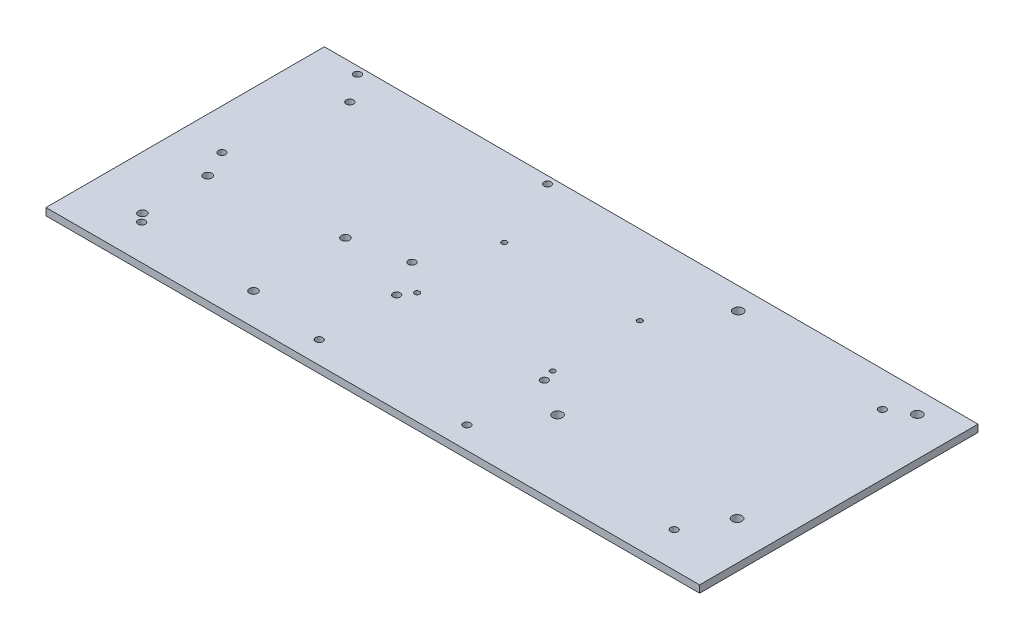
ISO-10303-21;
HEADER;
FILE_DESCRIPTION(('STEP AP214'),'2;1');
FILE_NAME('part.step','',(''),(''),'','','');
FILE_SCHEMA(('AUTOMOTIVE_DESIGN { 1 0 10303 214 1 1 1 1 }'));
ENDSEC;
DATA;
#1=APPLICATION_CONTEXT('core data for automotive mechanical design processes');
#2=APPLICATION_PROTOCOL_DEFINITION('international standard','automotive_design',2000,#1);
#3=PRODUCT_CONTEXT('',#1,'mechanical');
#4=PRODUCT('Part','Part','',(#3));
#5=PRODUCT_RELATED_PRODUCT_CATEGORY('part','',(#4));
#6=PRODUCT_DEFINITION_FORMATION('','',#4);
#7=PRODUCT_DEFINITION_CONTEXT('part definition',#1,'design');
#8=PRODUCT_DEFINITION('design','',#6,#7);
#9=PRODUCT_DEFINITION_SHAPE('','',#8);
#10=(LENGTH_UNIT() NAMED_UNIT(*) SI_UNIT(.MILLI.,.METRE.));
#11=(NAMED_UNIT(*) PLANE_ANGLE_UNIT() SI_UNIT($,.RADIAN.));
#12=(NAMED_UNIT(*) SI_UNIT($,.STERADIAN.) SOLID_ANGLE_UNIT());
#13=UNCERTAINTY_MEASURE_WITH_UNIT(LENGTH_MEASURE(1.E-05),#10,'distance_accuracy_value','');
#14=(GEOMETRIC_REPRESENTATION_CONTEXT(3) GLOBAL_UNCERTAINTY_ASSIGNED_CONTEXT((#13)) GLOBAL_UNIT_ASSIGNED_CONTEXT((#10,
#11,#12)) REPRESENTATION_CONTEXT('',''));
#15=CARTESIAN_POINT('',(0.,0.,0.));
#16=DIRECTION('',(0.,0.,1.));
#17=DIRECTION('',(1.,0.,0.));
#18=AXIS2_PLACEMENT_3D('',#15,#16,#17);
#19=CARTESIAN_POINT('',(-125.,3.,55.));
#20=DIRECTION('',(0.,0.,-1.));
#21=DIRECTION('',(-1.,0.,0.));
#22=AXIS2_PLACEMENT_3D('',#19,#20,#21);
#23=PLANE('',#22);
#24=DIRECTION('',(1.,0.,0.));
#25=VECTOR('',#24,1.);
#26=CARTESIAN_POINT('',(-125.,0.,55.));
#27=LINE('',#26,#25);
#28=CARTESIAN_POINT('',(-135.,0.,55.));
#29=VERTEX_POINT('',#28);
#30=CARTESIAN_POINT('',(135.,0.,55.));
#31=VERTEX_POINT('',#30);
#32=EDGE_CURVE('E75',#29,#31,#27,.T.);
#33=ORIENTED_EDGE('',*,*,#32,.T.);
#34=DIRECTION('',(0.,-1.,0.));
#35=VECTOR('',#34,1.);
#36=CARTESIAN_POINT('',(135.,3.,55.));
#37=LINE('',#36,#35);
#38=CARTESIAN_POINT('',(135.,3.,55.));
#39=VERTEX_POINT('',#38);
#40=EDGE_CURVE('E78',#39,#31,#37,.T.);
#41=ORIENTED_EDGE('',*,*,#40,.F.);
#42=DIRECTION('',(1.,0.,0.));
#43=VECTOR('',#42,1.);
#44=CARTESIAN_POINT('',(-125.,3.,55.));
#45=LINE('',#44,#43);
#46=CARTESIAN_POINT('',(-135.,3.,55.));
#47=VERTEX_POINT('',#46);
#48=EDGE_CURVE('E45',#47,#39,#45,.T.);
#49=ORIENTED_EDGE('',*,*,#48,.F.);
#50=DIRECTION('',(0.,1.,0.));
#51=VECTOR('',#50,1.);
#52=CARTESIAN_POINT('',(-135.,3.,55.));
#53=LINE('',#52,#51);
#54=EDGE_CURVE('E79',#29,#47,#53,.T.);
#55=ORIENTED_EDGE('',*,*,#54,.F.);
#56=EDGE_LOOP('',(#33,#41,#49,#55));
#57=FACE_BOUND('',#56,.T.);
#58=ADVANCED_FACE('F37',(#57),#23,.F.);
#59=CARTESIAN_POINT('',(-125.,3.,-60.));
#60=DIRECTION('',(0.,0.,1.));
#61=DIRECTION('',(1.,0.,0.));
#62=AXIS2_PLACEMENT_3D('',#59,#60,#61);
#63=PLANE('',#62);
#64=DIRECTION('',(-1.,0.,0.));
#65=VECTOR('',#64,1.);
#66=CARTESIAN_POINT('',(-125.,0.,-60.));
#67=LINE('',#66,#65);
#68=CARTESIAN_POINT('',(135.,0.,-60.));
#69=VERTEX_POINT('',#68);
#70=CARTESIAN_POINT('',(-135.,0.,-60.));
#71=VERTEX_POINT('',#70);
#72=EDGE_CURVE('E83',#69,#71,#67,.T.);
#73=ORIENTED_EDGE('',*,*,#72,.T.);
#74=DIRECTION('',(0.,-1.,0.));
#75=VECTOR('',#74,1.);
#76=CARTESIAN_POINT('',(-135.,3.,-60.));
#77=LINE('',#76,#75);
#78=CARTESIAN_POINT('',(-135.,3.,-60.));
#79=VERTEX_POINT('',#78);
#80=EDGE_CURVE('E106',#79,#71,#77,.T.);
#81=ORIENTED_EDGE('',*,*,#80,.F.);
#82=DIRECTION('',(-1.,0.,0.));
#83=VECTOR('',#82,1.);
#84=CARTESIAN_POINT('',(-125.,3.,-60.));
#85=LINE('',#84,#83);
#86=CARTESIAN_POINT('',(135.,3.,-60.));
#87=VERTEX_POINT('',#86);
#88=EDGE_CURVE('E11',#87,#79,#85,.T.);
#89=ORIENTED_EDGE('',*,*,#88,.F.);
#90=DIRECTION('',(0.,1.,0.));
#91=VECTOR('',#90,1.);
#92=CARTESIAN_POINT('',(135.,3.,-60.));
#93=LINE('',#92,#91);
#94=EDGE_CURVE('E92',#69,#87,#93,.T.);
#95=ORIENTED_EDGE('',*,*,#94,.F.);
#96=EDGE_LOOP('',(#73,#81,#89,#95));
#97=FACE_BOUND('',#96,.T.);
#98=ADVANCED_FACE('F263',(#97),#63,.F.);
#99=CARTESIAN_POINT('',(0.,3.,0.));
#100=DIRECTION('',(0.,1.,0.));
#101=DIRECTION('',(0.,0.,1.));
#102=AXIS2_PLACEMENT_3D('',#99,#100,#101);
#103=PLANE('',#102);
#104=CARTESIAN_POINT('',(-110.,3.,40.5));
#105=DIRECTION('',(0.,1.,0.));
#106=DIRECTION('',(0.,0.,1.));
#107=AXIS2_PLACEMENT_3D('',#104,#105,#106);
#108=CIRCLE('',#107,1.5);
#109=CARTESIAN_POINT('',(-110.,3.,42.));
#110=VERTEX_POINT('',#109);
#111=EDGE_CURVE('E433',#110,#110,#108,.T.);
#112=ORIENTED_EDGE('',*,*,#111,.F.);
#113=EDGE_LOOP('',(#112));
#114=FACE_BOUND('',#113,.T.);
#115=CARTESIAN_POINT('',(110.,3.,-45.4951683706963));
#116=DIRECTION('',(0.,1.,0.));
#117=DIRECTION('',(0.,0.,1.));
#118=AXIS2_PLACEMENT_3D('',#115,#116,#117);
#119=CIRCLE('',#118,1.49999999999998);
#120=CARTESIAN_POINT('',(110.,3.,-43.9951683706963));
#121=VERTEX_POINT('',#120);
#122=EDGE_CURVE('E435',#121,#121,#119,.T.);
#123=ORIENTED_EDGE('',*,*,#122,.F.);
#124=EDGE_LOOP('',(#123));
#125=FACE_BOUND('',#124,.T.);
#126=CARTESIAN_POINT('',(110.,3.,40.5));
#127=DIRECTION('',(0.,1.,0.));
#128=DIRECTION('',(0.,0.,1.));
#129=AXIS2_PLACEMENT_3D('',#126,#127,#128);
#130=CIRCLE('',#129,1.49999999999997);
#131=CARTESIAN_POINT('',(110.,3.,42.));
#132=VERTEX_POINT('',#131);
#133=EDGE_CURVE('E438',#132,#132,#130,.T.);
#134=ORIENTED_EDGE('',*,*,#133,.F.);
#135=EDGE_LOOP('',(#134));
#136=FACE_BOUND('',#135,.T.);
#137=CARTESIAN_POINT('',(-110.,3.,-45.4951683706963));
#138=DIRECTION('',(0.,1.,0.));
#139=DIRECTION('',(0.,0.,1.));
#140=AXIS2_PLACEMENT_3D('',#137,#138,#139);
#141=CIRCLE('',#140,1.5);
#142=CARTESIAN_POINT('',(-110.,3.,-43.9951683706963));
#143=VERTEX_POINT('',#142);
#144=EDGE_CURVE('E101',#143,#143,#141,.T.);
#145=ORIENTED_EDGE('',*,*,#144,.F.);
#146=EDGE_LOOP('',(#145));
#147=FACE_BOUND('',#146,.T.);
#148=CARTESIAN_POINT('',(-31.2999999996769,3.,13.8462386119452));
#149=DIRECTION('',(0.,1.,0.));
#150=DIRECTION('',(0.,0.,1.));
#151=AXIS2_PLACEMENT_3D('',#148,#149,#150);
#152=CIRCLE('',#151,1.49999999999998);
#153=CARTESIAN_POINT('',(-31.2999999996769,3.,15.3462386119452));
#154=VERTEX_POINT('',#153);
#155=EDGE_CURVE('E127',#154,#154,#152,.T.);
#156=ORIENTED_EDGE('',*,*,#155,.F.);
#157=EDGE_LOOP('',(#156));
#158=FACE_BOUND('',#157,.T.);
#159=CARTESIAN_POINT('',(-62.3,3.,42.));
#160=DIRECTION('',(0.,1.,0.));
#161=DIRECTION('',(0.,0.,1.));
#162=AXIS2_PLACEMENT_3D('',#159,#160,#161);
#163=CIRCLE('',#162,1.70000000000001);
#164=CARTESIAN_POINT('',(-62.3,3.,43.7));
#165=VERTEX_POINT('',#164);
#166=EDGE_CURVE('E136',#165,#165,#163,.T.);
#167=ORIENTED_EDGE('',*,*,#166,.F.);
#168=EDGE_LOOP('',(#167));
#169=FACE_BOUND('',#168,.T.);
#170=CARTESIAN_POINT('',(-62.3,3.,4.00000000000001));
#171=DIRECTION('',(0.,1.,0.));
#172=DIRECTION('',(0.,0.,1.));
#173=AXIS2_PLACEMENT_3D('',#170,#171,#172);
#174=CIRCLE('',#173,1.70000000000001);
#175=CARTESIAN_POINT('',(-62.3,3.,5.70000000000002));
#176=VERTEX_POINT('',#175);
#177=EDGE_CURVE('E139',#176,#176,#174,.T.);
#178=ORIENTED_EDGE('',*,*,#177,.F.);
#179=EDGE_LOOP('',(#178));
#180=FACE_BOUND('',#179,.T.);
#181=CARTESIAN_POINT('',(-113.,3.,37.16));
#182=DIRECTION('',(0.,1.,0.));
#183=DIRECTION('',(0.,0.,1.));
#184=AXIS2_PLACEMENT_3D('',#181,#182,#183);
#185=CIRCLE('',#184,1.70000000000001);
#186=CARTESIAN_POINT('',(-113.,3.,38.86));
#187=VERTEX_POINT('',#186);
#188=EDGE_CURVE('E142',#187,#187,#185,.T.);
#189=ORIENTED_EDGE('',*,*,#188,.F.);
#190=EDGE_LOOP('',(#189));
#191=FACE_BOUND('',#190,.T.);
#192=CARTESIAN_POINT('',(-31.2999999996769,3.,45.8462386119452));
#193=DIRECTION('',(0.,1.,0.));
#194=DIRECTION('',(0.,0.,1.));
#195=AXIS2_PLACEMENT_3D('',#192,#193,#194);
#196=CIRCLE('',#195,1.5);
#197=CARTESIAN_POINT('',(-31.2999999996769,3.,47.3462386119452));
#198=VERTEX_POINT('',#197);
#199=EDGE_CURVE('E124',#198,#198,#196,.T.);
#200=ORIENTED_EDGE('',*,*,#199,.F.);
#201=EDGE_LOOP('',(#200));
#202=FACE_BOUND('',#201,.T.);
#203=CARTESIAN_POINT('',(29.7000000003231,3.,45.8462386119452));
#204=DIRECTION('',(0.,1.,0.));
#205=DIRECTION('',(0.,0.,1.));
#206=AXIS2_PLACEMENT_3D('',#203,#204,#205);
#207=CIRCLE('',#206,1.49999999999996);
#208=CARTESIAN_POINT('',(29.7000000003231,3.,47.3462386119452));
#209=VERTEX_POINT('',#208);
#210=EDGE_CURVE('E128',#209,#209,#207,.T.);
#211=ORIENTED_EDGE('',*,*,#210,.F.);
#212=EDGE_LOOP('',(#211));
#213=FACE_BOUND('',#212,.T.);
#214=CARTESIAN_POINT('',(29.7000000003231,3.,13.8462386119452));
#215=DIRECTION('',(0.,1.,0.));
#216=DIRECTION('',(0.,0.,1.));
#217=AXIS2_PLACEMENT_3D('',#214,#215,#216);
#218=CIRCLE('',#217,1.49999999999998);
#219=CARTESIAN_POINT('',(29.7000000003231,3.,15.3462386119452));
#220=VERTEX_POINT('',#219);
#221=EDGE_CURVE('E131',#220,#220,#218,.T.);
#222=ORIENTED_EDGE('',*,*,#221,.F.);
#223=EDGE_LOOP('',(#222));
#224=FACE_BOUND('',#223,.T.);
#225=CARTESIAN_POINT('',(-27.8496231131986,3.,-27.1537613880548));
#226=DIRECTION('',(0.,1.,0.));
#227=DIRECTION('',(0.,0.,1.));
#228=AXIS2_PLACEMENT_3D('',#225,#226,#227);
#229=CIRCLE('',#228,1.05000000000001);
#230=CARTESIAN_POINT('',(-27.8496231131986,3.,-26.1037613880547));
#231=VERTEX_POINT('',#230);
#232=EDGE_CURVE('E118',#231,#231,#229,.T.);
#233=ORIENTED_EDGE('',*,*,#232,.F.);
#234=EDGE_LOOP('',(#233));
#235=FACE_BOUND('',#234,.T.);
#236=CARTESIAN_POINT('',(-118.331376221827,3.,-0.999999999999996));
#237=DIRECTION('',(0.,1.,0.));
#238=DIRECTION('',(0.,0.,1.));
#239=AXIS2_PLACEMENT_3D('',#236,#237,#238);
#240=CIRCLE('',#239,1.49999999999997);
#241=CARTESIAN_POINT('',(-118.331376221827,3.,0.499999999999972));
#242=VERTEX_POINT('',#241);
#243=EDGE_CURVE('E160',#242,#242,#240,.T.);
#244=ORIENTED_EDGE('',*,*,#243,.F.);
#245=EDGE_LOOP('',(#244));
#246=FACE_BOUND('',#245,.T.);
#247=CARTESIAN_POINT('',(-118.331376221827,3.,-57.));
#248=DIRECTION('',(0.,1.,0.));
#249=DIRECTION('',(0.,0.,1.));
#250=AXIS2_PLACEMENT_3D('',#247,#248,#249);
#251=CIRCLE('',#250,1.50000000000003);
#252=CARTESIAN_POINT('',(-118.331376221827,3.,-55.5));
#253=VERTEX_POINT('',#252);
#254=EDGE_CURVE('E164',#253,#253,#251,.T.);
#255=ORIENTED_EDGE('',*,*,#254,.F.);
#256=EDGE_LOOP('',(#255));
#257=FACE_BOUND('',#256,.T.);
#258=CARTESIAN_POINT('',(-39.8313762218269,3.,-57.));
#259=DIRECTION('',(0.,1.,0.));
#260=DIRECTION('',(0.,0.,1.));
#261=AXIS2_PLACEMENT_3D('',#258,#259,#260);
#262=CIRCLE('',#261,1.5);
#263=CARTESIAN_POINT('',(-39.8313762218269,3.,-55.5));
#264=VERTEX_POINT('',#263);
#265=EDGE_CURVE('E167',#264,#264,#262,.T.);
#266=ORIENTED_EDGE('',*,*,#265,.F.);
#267=EDGE_LOOP('',(#266));
#268=FACE_BOUND('',#267,.T.);
#269=CARTESIAN_POINT('',(119.,3.,-50.9662418860091));
#270=DIRECTION('',(0.,1.,0.));
#271=DIRECTION('',(0.,0.,1.));
#272=AXIS2_PLACEMENT_3D('',#269,#270,#271);
#273=CIRCLE('',#272,2.);
#274=CARTESIAN_POINT('',(119.,3.,-48.9662418860091));
#275=VERTEX_POINT('',#274);
#276=EDGE_CURVE('E157',#275,#275,#273,.T.);
#277=ORIENTED_EDGE('',*,*,#276,.F.);
#278=EDGE_LOOP('',(#277));
#279=FACE_BOUND('',#278,.T.);
#280=CARTESIAN_POINT('',(-113.,3.,10.2));
#281=DIRECTION('',(0.,1.,0.));
#282=DIRECTION('',(0.,0.,1.));
#283=AXIS2_PLACEMENT_3D('',#280,#281,#282);
#284=CIRCLE('',#283,1.70000000000001);
#285=CARTESIAN_POINT('',(-113.,3.,11.9));
#286=VERTEX_POINT('',#285);
#287=EDGE_CURVE('E145',#286,#286,#284,.T.);
#288=ORIENTED_EDGE('',*,*,#287,.F.);
#289=EDGE_LOOP('',(#288));
#290=FACE_BOUND('',#289,.T.);
#291=CARTESIAN_POINT('',(119.,3.,23.5337581139909));
#292=DIRECTION('',(0.,1.,0.));
#293=DIRECTION('',(0.,0.,1.));
#294=AXIS2_PLACEMENT_3D('',#291,#292,#293);
#295=CIRCLE('',#294,2.);
#296=CARTESIAN_POINT('',(119.,3.,25.5337581139909));
#297=VERTEX_POINT('',#296);
#298=EDGE_CURVE('E148',#297,#297,#295,.T.);
#299=ORIENTED_EDGE('',*,*,#298,.F.);
#300=EDGE_LOOP('',(#299));
#301=FACE_BOUND('',#300,.T.);
#302=CARTESIAN_POINT('',(44.8512198768461,3.,23.5337581139915));
#303=DIRECTION('',(0.,1.,0.));
#304=DIRECTION('',(0.,0.,1.));
#305=AXIS2_PLACEMENT_3D('',#302,#303,#304);
#306=CIRCLE('',#305,1.99999999999999);
#307=CARTESIAN_POINT('',(44.8512198768461,3.,25.5337581139915));
#308=VERTEX_POINT('',#307);
#309=EDGE_CURVE('E151',#308,#308,#306,.T.);
#310=ORIENTED_EDGE('',*,*,#309,.F.);
#311=EDGE_LOOP('',(#310));
#312=FACE_BOUND('',#311,.T.);
#313=CARTESIAN_POINT('',(45.,3.,-50.9662418860091));
#314=DIRECTION('',(0.,1.,0.));
#315=DIRECTION('',(0.,0.,1.));
#316=AXIS2_PLACEMENT_3D('',#313,#314,#315);
#317=CIRCLE('',#316,2.);
#318=CARTESIAN_POINT('',(45.,3.,-48.9662418860091));
#319=VERTEX_POINT('',#318);
#320=EDGE_CURVE('E154',#319,#319,#317,.T.);
#321=ORIENTED_EDGE('',*,*,#320,.F.);
#322=EDGE_LOOP('',(#321));
#323=FACE_BOUND('',#322,.T.);
#324=CARTESIAN_POINT('',(-27.8496231131986,3.,8.84623861194524));
#325=DIRECTION('',(0.,1.,0.));
#326=DIRECTION('',(0.,0.,1.));
#327=AXIS2_PLACEMENT_3D('',#324,#325,#326);
#328=CIRCLE('',#327,1.05);
#329=CARTESIAN_POINT('',(-27.8496231131986,3.,9.89623861194524));
#330=VERTEX_POINT('',#329);
#331=EDGE_CURVE('E115',#330,#330,#328,.T.);
#332=ORIENTED_EDGE('',*,*,#331,.F.);
#333=EDGE_LOOP('',(#332));
#334=FACE_BOUND('',#333,.T.);
#335=CARTESIAN_POINT('',(28.1503768868014,3.,8.84623861194524));
#336=DIRECTION('',(0.,1.,0.));
#337=DIRECTION('',(0.,0.,1.));
#338=AXIS2_PLACEMENT_3D('',#335,#336,#337);
#339=CIRCLE('',#338,1.05);
#340=CARTESIAN_POINT('',(28.1503768868014,3.,9.89623861194524));
#341=VERTEX_POINT('',#340);
#342=EDGE_CURVE('E119',#341,#341,#339,.T.);
#343=ORIENTED_EDGE('',*,*,#342,.F.);
#344=EDGE_LOOP('',(#343));
#345=FACE_BOUND('',#344,.T.);
#346=CARTESIAN_POINT('',(28.1503768868014,3.,-27.1537613880548));
#347=DIRECTION('',(0.,1.,0.));
#348=DIRECTION('',(0.,0.,1.));
#349=AXIS2_PLACEMENT_3D('',#346,#347,#348);
#350=CIRCLE('',#349,1.05);
#351=CARTESIAN_POINT('',(28.1503768868014,3.,-26.1037613880547));
#352=VERTEX_POINT('',#351);
#353=EDGE_CURVE('E114',#352,#352,#350,.T.);
#354=ORIENTED_EDGE('',*,*,#353,.F.);
#355=EDGE_LOOP('',(#354));
#356=FACE_BOUND('',#355,.T.);
#357=CARTESIAN_POINT('',(-39.831376221827,3.,-1.));
#358=DIRECTION('',(0.,1.,0.));
#359=DIRECTION('',(0.,0.,1.));
#360=AXIS2_PLACEMENT_3D('',#357,#358,#359);
#361=CIRCLE('',#360,1.5);
#362=CARTESIAN_POINT('',(-39.831376221827,3.,0.500000000000001));
#363=VERTEX_POINT('',#362);
#364=EDGE_CURVE('E163',#363,#363,#361,.T.);
#365=ORIENTED_EDGE('',*,*,#364,.F.);
#366=EDGE_LOOP('',(#365));
#367=FACE_BOUND('',#366,.T.);
#368=ORIENTED_EDGE('',*,*,#88,.T.);
#369=DIRECTION('',(0.,0.,-1.));
#370=VECTOR('',#369,1.);
#371=CARTESIAN_POINT('',(-135.,3.,-60.));
#372=LINE('',#371,#370);
#373=EDGE_CURVE('E112',#47,#79,#372,.T.);
#374=ORIENTED_EDGE('',*,*,#373,.F.);
#375=ORIENTED_EDGE('',*,*,#48,.T.);
#376=DIRECTION('',(0.,0.,1.));
#377=VECTOR('',#376,1.);
#378=CARTESIAN_POINT('',(135.,3.,55.));
#379=LINE('',#378,#377);
#380=EDGE_CURVE('E96',#87,#39,#379,.T.);
#381=ORIENTED_EDGE('',*,*,#380,.F.);
#382=EDGE_LOOP('',(#368,#374,#375,#381));
#383=FACE_BOUND('',#382,.T.);
#384=ADVANCED_FACE('F267',(#114,#125,#136,#147,#158,#169,#180,#191,#202,#213,#224,#235,#246,
#257,#268,#279,#290,#301,#312,#323,#334,#345,#356,#367,#383),#103,.T.);
#385=CARTESIAN_POINT('',(0.,0.,0.));
#386=DIRECTION('',(0.,1.,0.));
#387=DIRECTION('',(0.,0.,1.));
#388=AXIS2_PLACEMENT_3D('',#385,#386,#387);
#389=PLANE('',#388);
#390=CARTESIAN_POINT('',(-110.,0.,40.5));
#391=DIRECTION('',(0.,1.,0.));
#392=DIRECTION('',(0.,0.,1.));
#393=AXIS2_PLACEMENT_3D('',#390,#391,#392);
#394=CIRCLE('',#393,1.5);
#395=CARTESIAN_POINT('',(-110.,0.,42.));
#396=VERTEX_POINT('',#395);
#397=EDGE_CURVE('E40',#396,#396,#394,.T.);
#398=ORIENTED_EDGE('',*,*,#397,.T.);
#399=EDGE_LOOP('',(#398));
#400=FACE_BOUND('',#399,.T.);
#401=CARTESIAN_POINT('',(110.,0.,-45.4951683706963));
#402=DIRECTION('',(0.,1.,0.));
#403=DIRECTION('',(0.,0.,1.));
#404=AXIS2_PLACEMENT_3D('',#401,#402,#403);
#405=CIRCLE('',#404,1.49999999999998);
#406=CARTESIAN_POINT('',(110.,0.,-43.9951683706963));
#407=VERTEX_POINT('',#406);
#408=EDGE_CURVE('E99',#407,#407,#405,.T.);
#409=ORIENTED_EDGE('',*,*,#408,.T.);
#410=EDGE_LOOP('',(#409));
#411=FACE_BOUND('',#410,.T.);
#412=CARTESIAN_POINT('',(110.,0.,40.5));
#413=DIRECTION('',(0.,1.,0.));
#414=DIRECTION('',(0.,0.,1.));
#415=AXIS2_PLACEMENT_3D('',#412,#413,#414);
#416=CIRCLE('',#415,1.49999999999997);
#417=CARTESIAN_POINT('',(110.,0.,42.));
#418=VERTEX_POINT('',#417);
#419=EDGE_CURVE('E238',#418,#418,#416,.T.);
#420=ORIENTED_EDGE('',*,*,#419,.T.);
#421=EDGE_LOOP('',(#420));
#422=FACE_BOUND('',#421,.T.);
#423=CARTESIAN_POINT('',(-110.,0.,-45.4951683706963));
#424=DIRECTION('',(0.,1.,0.));
#425=DIRECTION('',(0.,0.,1.));
#426=AXIS2_PLACEMENT_3D('',#423,#424,#425);
#427=CIRCLE('',#426,1.5);
#428=CARTESIAN_POINT('',(-110.,0.,-43.9951683706963));
#429=VERTEX_POINT('',#428);
#430=EDGE_CURVE('E235',#429,#429,#427,.T.);
#431=ORIENTED_EDGE('',*,*,#430,.T.);
#432=EDGE_LOOP('',(#431));
#433=FACE_BOUND('',#432,.T.);
#434=CARTESIAN_POINT('',(-31.2999999996769,0.,13.8462386119452));
#435=DIRECTION('',(0.,1.,0.));
#436=DIRECTION('',(0.,0.,1.));
#437=AXIS2_PLACEMENT_3D('',#434,#435,#436);
#438=CIRCLE('',#437,1.49999999999998);
#439=CARTESIAN_POINT('',(-31.2999999996769,0.,15.3462386119452));
#440=VERTEX_POINT('',#439);
#441=EDGE_CURVE('E84',#440,#440,#438,.T.);
#442=ORIENTED_EDGE('',*,*,#441,.T.);
#443=EDGE_LOOP('',(#442));
#444=FACE_BOUND('',#443,.T.);
#445=CARTESIAN_POINT('',(-62.3,0.,42.));
#446=DIRECTION('',(0.,1.,0.));
#447=DIRECTION('',(0.,0.,1.));
#448=AXIS2_PLACEMENT_3D('',#445,#446,#447);
#449=CIRCLE('',#448,1.70000000000001);
#450=CARTESIAN_POINT('',(-62.3,0.,43.7));
#451=VERTEX_POINT('',#450);
#452=EDGE_CURVE('E230',#451,#451,#449,.T.);
#453=ORIENTED_EDGE('',*,*,#452,.T.);
#454=EDGE_LOOP('',(#453));
#455=FACE_BOUND('',#454,.T.);
#456=CARTESIAN_POINT('',(-62.3,0.,4.00000000000001));
#457=DIRECTION('',(0.,1.,0.));
#458=DIRECTION('',(0.,0.,1.));
#459=AXIS2_PLACEMENT_3D('',#456,#457,#458);
#460=CIRCLE('',#459,1.70000000000001);
#461=CARTESIAN_POINT('',(-62.3,0.,5.70000000000002));
#462=VERTEX_POINT('',#461);
#463=EDGE_CURVE('E227',#462,#462,#460,.T.);
#464=ORIENTED_EDGE('',*,*,#463,.T.);
#465=EDGE_LOOP('',(#464));
#466=FACE_BOUND('',#465,.T.);
#467=CARTESIAN_POINT('',(-113.,0.,37.16));
#468=DIRECTION('',(0.,1.,0.));
#469=DIRECTION('',(0.,0.,1.));
#470=AXIS2_PLACEMENT_3D('',#467,#468,#469);
#471=CIRCLE('',#470,1.70000000000001);
#472=CARTESIAN_POINT('',(-113.,0.,38.86));
#473=VERTEX_POINT('',#472);
#474=EDGE_CURVE('E224',#473,#473,#471,.T.);
#475=ORIENTED_EDGE('',*,*,#474,.T.);
#476=EDGE_LOOP('',(#475));
#477=FACE_BOUND('',#476,.T.);
#478=CARTESIAN_POINT('',(-31.2999999996769,0.,45.8462386119452));
#479=DIRECTION('',(0.,1.,0.));
#480=DIRECTION('',(0.,0.,1.));
#481=AXIS2_PLACEMENT_3D('',#478,#479,#480);
#482=CIRCLE('',#481,1.5);
#483=CARTESIAN_POINT('',(-31.2999999996769,0.,47.3462386119452));
#484=VERTEX_POINT('',#483);
#485=EDGE_CURVE('E221',#484,#484,#482,.T.);
#486=ORIENTED_EDGE('',*,*,#485,.T.);
#487=EDGE_LOOP('',(#486));
#488=FACE_BOUND('',#487,.T.);
#489=CARTESIAN_POINT('',(29.7000000003231,0.,45.8462386119452));
#490=DIRECTION('',(0.,1.,0.));
#491=DIRECTION('',(0.,0.,1.));
#492=AXIS2_PLACEMENT_3D('',#489,#490,#491);
#493=CIRCLE('',#492,1.49999999999996);
#494=CARTESIAN_POINT('',(29.7000000003231,0.,47.3462386119452));
#495=VERTEX_POINT('',#494);
#496=EDGE_CURVE('E218',#495,#495,#493,.T.);
#497=ORIENTED_EDGE('',*,*,#496,.T.);
#498=EDGE_LOOP('',(#497));
#499=FACE_BOUND('',#498,.T.);
#500=CARTESIAN_POINT('',(29.7000000003231,0.,13.8462386119452));
#501=DIRECTION('',(0.,1.,0.));
#502=DIRECTION('',(0.,0.,1.));
#503=AXIS2_PLACEMENT_3D('',#500,#501,#502);
#504=CIRCLE('',#503,1.49999999999998);
#505=CARTESIAN_POINT('',(29.7000000003231,0.,15.3462386119452));
#506=VERTEX_POINT('',#505);
#507=EDGE_CURVE('E215',#506,#506,#504,.T.);
#508=ORIENTED_EDGE('',*,*,#507,.T.);
#509=EDGE_LOOP('',(#508));
#510=FACE_BOUND('',#509,.T.);
#511=CARTESIAN_POINT('',(-27.8496231131986,0.,-27.1537613880548));
#512=DIRECTION('',(0.,1.,0.));
#513=DIRECTION('',(0.,0.,1.));
#514=AXIS2_PLACEMENT_3D('',#511,#512,#513);
#515=CIRCLE('',#514,1.05000000000001);
#516=CARTESIAN_POINT('',(-27.8496231131986,0.,-26.1037613880547));
#517=VERTEX_POINT('',#516);
#518=EDGE_CURVE('E212',#517,#517,#515,.T.);
#519=ORIENTED_EDGE('',*,*,#518,.T.);
#520=EDGE_LOOP('',(#519));
#521=FACE_BOUND('',#520,.T.);
#522=CARTESIAN_POINT('',(-118.331376221827,0.,-0.999999999999996));
#523=DIRECTION('',(0.,1.,0.));
#524=DIRECTION('',(0.,0.,1.));
#525=AXIS2_PLACEMENT_3D('',#522,#523,#524);
#526=CIRCLE('',#525,1.49999999999997);
#527=CARTESIAN_POINT('',(-118.331376221827,0.,0.499999999999972));
#528=VERTEX_POINT('',#527);
#529=EDGE_CURVE('E209',#528,#528,#526,.T.);
#530=ORIENTED_EDGE('',*,*,#529,.T.);
#531=EDGE_LOOP('',(#530));
#532=FACE_BOUND('',#531,.T.);
#533=CARTESIAN_POINT('',(-118.331376221827,0.,-57.));
#534=DIRECTION('',(0.,1.,0.));
#535=DIRECTION('',(0.,0.,1.));
#536=AXIS2_PLACEMENT_3D('',#533,#534,#535);
#537=CIRCLE('',#536,1.50000000000003);
#538=CARTESIAN_POINT('',(-118.331376221827,0.,-55.5));
#539=VERTEX_POINT('',#538);
#540=EDGE_CURVE('E206',#539,#539,#537,.T.);
#541=ORIENTED_EDGE('',*,*,#540,.T.);
#542=EDGE_LOOP('',(#541));
#543=FACE_BOUND('',#542,.T.);
#544=CARTESIAN_POINT('',(-39.8313762218269,0.,-57.));
#545=DIRECTION('',(0.,1.,0.));
#546=DIRECTION('',(0.,0.,1.));
#547=AXIS2_PLACEMENT_3D('',#544,#545,#546);
#548=CIRCLE('',#547,1.5);
#549=CARTESIAN_POINT('',(-39.8313762218269,0.,-55.5));
#550=VERTEX_POINT('',#549);
#551=EDGE_CURVE('E203',#550,#550,#548,.T.);
#552=ORIENTED_EDGE('',*,*,#551,.T.);
#553=EDGE_LOOP('',(#552));
#554=FACE_BOUND('',#553,.T.);
#555=CARTESIAN_POINT('',(119.,0.,-50.9662418860091));
#556=DIRECTION('',(0.,1.,0.));
#557=DIRECTION('',(0.,0.,1.));
#558=AXIS2_PLACEMENT_3D('',#555,#556,#557);
#559=CIRCLE('',#558,2.);
#560=CARTESIAN_POINT('',(119.,0.,-48.9662418860091));
#561=VERTEX_POINT('',#560);
#562=EDGE_CURVE('E200',#561,#561,#559,.T.);
#563=ORIENTED_EDGE('',*,*,#562,.T.);
#564=EDGE_LOOP('',(#563));
#565=FACE_BOUND('',#564,.T.);
#566=CARTESIAN_POINT('',(-113.,0.,10.2));
#567=DIRECTION('',(0.,1.,0.));
#568=DIRECTION('',(0.,0.,1.));
#569=AXIS2_PLACEMENT_3D('',#566,#567,#568);
#570=CIRCLE('',#569,1.70000000000001);
#571=CARTESIAN_POINT('',(-113.,0.,11.9));
#572=VERTEX_POINT('',#571);
#573=EDGE_CURVE('E197',#572,#572,#570,.T.);
#574=ORIENTED_EDGE('',*,*,#573,.T.);
#575=EDGE_LOOP('',(#574));
#576=FACE_BOUND('',#575,.T.);
#577=CARTESIAN_POINT('',(119.,0.,23.5337581139909));
#578=DIRECTION('',(0.,1.,0.));
#579=DIRECTION('',(0.,0.,1.));
#580=AXIS2_PLACEMENT_3D('',#577,#578,#579);
#581=CIRCLE('',#580,2.);
#582=CARTESIAN_POINT('',(119.,0.,25.5337581139909));
#583=VERTEX_POINT('',#582);
#584=EDGE_CURVE('E194',#583,#583,#581,.T.);
#585=ORIENTED_EDGE('',*,*,#584,.T.);
#586=EDGE_LOOP('',(#585));
#587=FACE_BOUND('',#586,.T.);
#588=CARTESIAN_POINT('',(44.8512198768461,0.,23.5337581139915));
#589=DIRECTION('',(0.,1.,0.));
#590=DIRECTION('',(0.,0.,1.));
#591=AXIS2_PLACEMENT_3D('',#588,#589,#590);
#592=CIRCLE('',#591,1.99999999999999);
#593=CARTESIAN_POINT('',(44.8512198768461,0.,25.5337581139915));
#594=VERTEX_POINT('',#593);
#595=EDGE_CURVE('E191',#594,#594,#592,.T.);
#596=ORIENTED_EDGE('',*,*,#595,.T.);
#597=EDGE_LOOP('',(#596));
#598=FACE_BOUND('',#597,.T.);
#599=CARTESIAN_POINT('',(45.,0.,-50.9662418860091));
#600=DIRECTION('',(0.,1.,0.));
#601=DIRECTION('',(0.,0.,1.));
#602=AXIS2_PLACEMENT_3D('',#599,#600,#601);
#603=CIRCLE('',#602,2.);
#604=CARTESIAN_POINT('',(45.,0.,-48.9662418860091));
#605=VERTEX_POINT('',#604);
#606=EDGE_CURVE('E188',#605,#605,#603,.T.);
#607=ORIENTED_EDGE('',*,*,#606,.T.);
#608=EDGE_LOOP('',(#607));
#609=FACE_BOUND('',#608,.T.);
#610=CARTESIAN_POINT('',(-27.8496231131986,0.,8.84623861194524));
#611=DIRECTION('',(0.,1.,0.));
#612=DIRECTION('',(0.,0.,1.));
#613=AXIS2_PLACEMENT_3D('',#610,#611,#612);
#614=CIRCLE('',#613,1.05);
#615=CARTESIAN_POINT('',(-27.8496231131986,0.,9.89623861194524));
#616=VERTEX_POINT('',#615);
#617=EDGE_CURVE('E185',#616,#616,#614,.T.);
#618=ORIENTED_EDGE('',*,*,#617,.T.);
#619=EDGE_LOOP('',(#618));
#620=FACE_BOUND('',#619,.T.);
#621=CARTESIAN_POINT('',(28.1503768868014,0.,8.84623861194524));
#622=DIRECTION('',(0.,1.,0.));
#623=DIRECTION('',(0.,0.,1.));
#624=AXIS2_PLACEMENT_3D('',#621,#622,#623);
#625=CIRCLE('',#624,1.05);
#626=CARTESIAN_POINT('',(28.1503768868014,0.,9.89623861194524));
#627=VERTEX_POINT('',#626);
#628=EDGE_CURVE('E182',#627,#627,#625,.T.);
#629=ORIENTED_EDGE('',*,*,#628,.T.);
#630=EDGE_LOOP('',(#629));
#631=FACE_BOUND('',#630,.T.);
#632=CARTESIAN_POINT('',(28.1503768868014,0.,-27.1537613880548));
#633=DIRECTION('',(0.,1.,0.));
#634=DIRECTION('',(0.,0.,1.));
#635=AXIS2_PLACEMENT_3D('',#632,#633,#634);
#636=CIRCLE('',#635,1.05);
#637=CARTESIAN_POINT('',(28.1503768868014,0.,-26.1037613880547));
#638=VERTEX_POINT('',#637);
#639=EDGE_CURVE('E179',#638,#638,#636,.T.);
#640=ORIENTED_EDGE('',*,*,#639,.T.);
#641=EDGE_LOOP('',(#640));
#642=FACE_BOUND('',#641,.T.);
#643=CARTESIAN_POINT('',(-39.831376221827,0.,-1.));
#644=DIRECTION('',(0.,1.,0.));
#645=DIRECTION('',(0.,0.,1.));
#646=AXIS2_PLACEMENT_3D('',#643,#644,#645);
#647=CIRCLE('',#646,1.5);
#648=CARTESIAN_POINT('',(-39.831376221827,0.,0.500000000000001));
#649=VERTEX_POINT('',#648);
#650=EDGE_CURVE('E174',#649,#649,#647,.T.);
#651=ORIENTED_EDGE('',*,*,#650,.T.);
#652=EDGE_LOOP('',(#651));
#653=FACE_BOUND('',#652,.T.);
#654=ORIENTED_EDGE('',*,*,#32,.F.);
#655=DIRECTION('',(0.,0.,1.));
#656=VECTOR('',#655,1.);
#657=CARTESIAN_POINT('',(-135.,0.,-60.));
#658=LINE('',#657,#656);
#659=EDGE_CURVE('E109',#71,#29,#658,.T.);
#660=ORIENTED_EDGE('',*,*,#659,.F.);
#661=ORIENTED_EDGE('',*,*,#72,.F.);
#662=DIRECTION('',(0.,0.,-1.));
#663=VECTOR('',#662,1.);
#664=CARTESIAN_POINT('',(135.,0.,55.));
#665=LINE('',#664,#663);
#666=EDGE_CURVE('E87',#31,#69,#665,.T.);
#667=ORIENTED_EDGE('',*,*,#666,.F.);
#668=EDGE_LOOP('',(#654,#660,#661,#667));
#669=FACE_BOUND('',#668,.T.);
#670=ADVANCED_FACE('F88',(#400,#411,#422,#433,#444,#455,#466,#477,#488,#499,#510,#521,#532,#543,
#554,#565,#576,#587,#598,#609,#620,#631,#642,#653,#669),#389,.F.);
#671=CARTESIAN_POINT('',(-39.831376221827,-7.,-1.));
#672=DIRECTION('',(0.,1.,0.));
#673=DIRECTION('',(0.,0.,1.));
#674=AXIS2_PLACEMENT_3D('',#671,#672,#673);
#675=CYLINDRICAL_SURFACE('',#674,1.5);
#676=ORIENTED_EDGE('',*,*,#364,.T.);
#677=EDGE_LOOP('',(#676));
#678=FACE_BOUND('',#677,.T.);
#679=ORIENTED_EDGE('',*,*,#650,.F.);
#680=EDGE_LOOP('',(#679));
#681=FACE_BOUND('',#680,.T.);
#682=ADVANCED_FACE('F276',(#678,#681),#675,.F.);
#683=CARTESIAN_POINT('',(28.1503768868014,-7.,-27.1537613880548));
#684=DIRECTION('',(0.,1.,0.));
#685=DIRECTION('',(0.,0.,1.));
#686=AXIS2_PLACEMENT_3D('',#683,#684,#685);
#687=CYLINDRICAL_SURFACE('',#686,1.05);
#688=ORIENTED_EDGE('',*,*,#353,.T.);
#689=EDGE_LOOP('',(#688));
#690=FACE_BOUND('',#689,.T.);
#691=ORIENTED_EDGE('',*,*,#639,.F.);
#692=EDGE_LOOP('',(#691));
#693=FACE_BOUND('',#692,.T.);
#694=ADVANCED_FACE('F281',(#690,#693),#687,.F.);
#695=CARTESIAN_POINT('',(28.1503768868014,-7.,8.84623861194524));
#696=DIRECTION('',(0.,1.,0.));
#697=DIRECTION('',(0.,0.,1.));
#698=AXIS2_PLACEMENT_3D('',#695,#696,#697);
#699=CYLINDRICAL_SURFACE('',#698,1.05);
#700=ORIENTED_EDGE('',*,*,#342,.T.);
#701=EDGE_LOOP('',(#700));
#702=FACE_BOUND('',#701,.T.);
#703=ORIENTED_EDGE('',*,*,#628,.F.);
#704=EDGE_LOOP('',(#703));
#705=FACE_BOUND('',#704,.T.);
#706=ADVANCED_FACE('F351',(#702,#705),#699,.F.);
#707=CARTESIAN_POINT('',(-27.8496231131986,-7.,8.84623861194524));
#708=DIRECTION('',(0.,1.,0.));
#709=DIRECTION('',(0.,0.,1.));
#710=AXIS2_PLACEMENT_3D('',#707,#708,#709);
#711=CYLINDRICAL_SURFACE('',#710,1.05);
#712=ORIENTED_EDGE('',*,*,#331,.T.);
#713=EDGE_LOOP('',(#712));
#714=FACE_BOUND('',#713,.T.);
#715=ORIENTED_EDGE('',*,*,#617,.F.);
#716=EDGE_LOOP('',(#715));
#717=FACE_BOUND('',#716,.T.);
#718=ADVANCED_FACE('F309',(#714,#717),#711,.F.);
#719=CARTESIAN_POINT('',(45.,-7.,-50.9662418860091));
#720=DIRECTION('',(0.,1.,0.));
#721=DIRECTION('',(0.,0.,1.));
#722=AXIS2_PLACEMENT_3D('',#719,#720,#721);
#723=CYLINDRICAL_SURFACE('',#722,2.);
#724=ORIENTED_EDGE('',*,*,#320,.T.);
#725=EDGE_LOOP('',(#724));
#726=FACE_BOUND('',#725,.T.);
#727=ORIENTED_EDGE('',*,*,#606,.F.);
#728=EDGE_LOOP('',(#727));
#729=FACE_BOUND('',#728,.T.);
#730=ADVANCED_FACE('F305',(#726,#729),#723,.F.);
#731=CARTESIAN_POINT('',(44.8512198768461,-7.,23.5337581139915));
#732=DIRECTION('',(0.,1.,0.));
#733=DIRECTION('',(0.,0.,1.));
#734=AXIS2_PLACEMENT_3D('',#731,#732,#733);
#735=CYLINDRICAL_SURFACE('',#734,1.99999999999999);
#736=ORIENTED_EDGE('',*,*,#309,.T.);
#737=EDGE_LOOP('',(#736));
#738=FACE_BOUND('',#737,.T.);
#739=ORIENTED_EDGE('',*,*,#595,.F.);
#740=EDGE_LOOP('',(#739));
#741=FACE_BOUND('',#740,.T.);
#742=ADVANCED_FACE('F301',(#738,#741),#735,.F.);
#743=CARTESIAN_POINT('',(119.,-7.,23.5337581139909));
#744=DIRECTION('',(0.,1.,0.));
#745=DIRECTION('',(0.,0.,1.));
#746=AXIS2_PLACEMENT_3D('',#743,#744,#745);
#747=CYLINDRICAL_SURFACE('',#746,2.);
#748=ORIENTED_EDGE('',*,*,#298,.T.);
#749=EDGE_LOOP('',(#748));
#750=FACE_BOUND('',#749,.T.);
#751=ORIENTED_EDGE('',*,*,#584,.F.);
#752=EDGE_LOOP('',(#751));
#753=FACE_BOUND('',#752,.T.);
#754=ADVANCED_FACE('F304',(#750,#753),#747,.F.);
#755=CARTESIAN_POINT('',(-113.,-7.,10.2));
#756=DIRECTION('',(0.,1.,0.));
#757=DIRECTION('',(0.,0.,1.));
#758=AXIS2_PLACEMENT_3D('',#755,#756,#757);
#759=CYLINDRICAL_SURFACE('',#758,1.70000000000001);
#760=ORIENTED_EDGE('',*,*,#287,.T.);
#761=EDGE_LOOP('',(#760));
#762=FACE_BOUND('',#761,.T.);
#763=ORIENTED_EDGE('',*,*,#573,.F.);
#764=EDGE_LOOP('',(#763));
#765=FACE_BOUND('',#764,.T.);
#766=ADVANCED_FACE('F287',(#762,#765),#759,.F.);
#767=CARTESIAN_POINT('',(119.,-7.,-50.9662418860091));
#768=DIRECTION('',(0.,1.,0.));
#769=DIRECTION('',(0.,0.,1.));
#770=AXIS2_PLACEMENT_3D('',#767,#768,#769);
#771=CYLINDRICAL_SURFACE('',#770,2.);
#772=ORIENTED_EDGE('',*,*,#276,.T.);
#773=EDGE_LOOP('',(#772));
#774=FACE_BOUND('',#773,.T.);
#775=ORIENTED_EDGE('',*,*,#562,.F.);
#776=EDGE_LOOP('',(#775));
#777=FACE_BOUND('',#776,.T.);
#778=ADVANCED_FACE('F283',(#774,#777),#771,.F.);
#779=CARTESIAN_POINT('',(-39.8313762218269,-7.,-57.));
#780=DIRECTION('',(0.,1.,0.));
#781=DIRECTION('',(0.,0.,1.));
#782=AXIS2_PLACEMENT_3D('',#779,#780,#781);
#783=CYLINDRICAL_SURFACE('',#782,1.5);
#784=ORIENTED_EDGE('',*,*,#265,.T.);
#785=EDGE_LOOP('',(#784));
#786=FACE_BOUND('',#785,.T.);
#787=ORIENTED_EDGE('',*,*,#551,.F.);
#788=EDGE_LOOP('',(#787));
#789=FACE_BOUND('',#788,.T.);
#790=ADVANCED_FACE('F286',(#786,#789),#783,.F.);
#791=CARTESIAN_POINT('',(-118.331376221827,-7.,-57.));
#792=DIRECTION('',(0.,1.,0.));
#793=DIRECTION('',(0.,0.,1.));
#794=AXIS2_PLACEMENT_3D('',#791,#792,#793);
#795=CYLINDRICAL_SURFACE('',#794,1.50000000000003);
#796=ORIENTED_EDGE('',*,*,#254,.T.);
#797=EDGE_LOOP('',(#796));
#798=FACE_BOUND('',#797,.T.);
#799=ORIENTED_EDGE('',*,*,#540,.F.);
#800=EDGE_LOOP('',(#799));
#801=FACE_BOUND('',#800,.T.);
#802=ADVANCED_FACE('F291',(#798,#801),#795,.F.);
#803=CARTESIAN_POINT('',(-118.331376221827,-7.,-0.999999999999996));
#804=DIRECTION('',(0.,1.,0.));
#805=DIRECTION('',(0.,0.,1.));
#806=AXIS2_PLACEMENT_3D('',#803,#804,#805);
#807=CYLINDRICAL_SURFACE('',#806,1.49999999999997);
#808=ORIENTED_EDGE('',*,*,#243,.T.);
#809=EDGE_LOOP('',(#808));
#810=FACE_BOUND('',#809,.T.);
#811=ORIENTED_EDGE('',*,*,#529,.F.);
#812=EDGE_LOOP('',(#811));
#813=FACE_BOUND('',#812,.T.);
#814=ADVANCED_FACE('F295',(#810,#813),#807,.F.);
#815=CARTESIAN_POINT('',(-27.8496231131986,-7.,-27.1537613880548));
#816=DIRECTION('',(0.,1.,0.));
#817=DIRECTION('',(0.,0.,1.));
#818=AXIS2_PLACEMENT_3D('',#815,#816,#817);
#819=CYLINDRICAL_SURFACE('',#818,1.05000000000001);
#820=ORIENTED_EDGE('',*,*,#232,.T.);
#821=EDGE_LOOP('',(#820));
#822=FACE_BOUND('',#821,.T.);
#823=ORIENTED_EDGE('',*,*,#518,.F.);
#824=EDGE_LOOP('',(#823));
#825=FACE_BOUND('',#824,.T.);
#826=ADVANCED_FACE('F299',(#822,#825),#819,.F.);
#827=CARTESIAN_POINT('',(29.7000000003231,-7.,13.8462386119452));
#828=DIRECTION('',(0.,1.,0.));
#829=DIRECTION('',(0.,0.,1.));
#830=AXIS2_PLACEMENT_3D('',#827,#828,#829);
#831=CYLINDRICAL_SURFACE('',#830,1.49999999999998);
#832=ORIENTED_EDGE('',*,*,#221,.T.);
#833=EDGE_LOOP('',(#832));
#834=FACE_BOUND('',#833,.T.);
#835=ORIENTED_EDGE('',*,*,#507,.F.);
#836=EDGE_LOOP('',(#835));
#837=FACE_BOUND('',#836,.T.);
#838=ADVANCED_FACE('F337',(#834,#837),#831,.F.);
#839=CARTESIAN_POINT('',(29.7000000003231,-7.,45.8462386119452));
#840=DIRECTION('',(0.,1.,0.));
#841=DIRECTION('',(0.,0.,1.));
#842=AXIS2_PLACEMENT_3D('',#839,#840,#841);
#843=CYLINDRICAL_SURFACE('',#842,1.49999999999996);
#844=ORIENTED_EDGE('',*,*,#210,.T.);
#845=EDGE_LOOP('',(#844));
#846=FACE_BOUND('',#845,.T.);
#847=ORIENTED_EDGE('',*,*,#496,.F.);
#848=EDGE_LOOP('',(#847));
#849=FACE_BOUND('',#848,.T.);
#850=ADVANCED_FACE('F341',(#846,#849),#843,.F.);
#851=CARTESIAN_POINT('',(-31.2999999996769,-7.,45.8462386119452));
#852=DIRECTION('',(0.,1.,0.));
#853=DIRECTION('',(0.,0.,1.));
#854=AXIS2_PLACEMENT_3D('',#851,#852,#853);
#855=CYLINDRICAL_SURFACE('',#854,1.5);
#856=ORIENTED_EDGE('',*,*,#199,.T.);
#857=EDGE_LOOP('',(#856));
#858=FACE_BOUND('',#857,.T.);
#859=ORIENTED_EDGE('',*,*,#485,.F.);
#860=EDGE_LOOP('',(#859));
#861=FACE_BOUND('',#860,.T.);
#862=ADVANCED_FACE('F325',(#858,#861),#855,.F.);
#863=CARTESIAN_POINT('',(-113.,-7.,37.16));
#864=DIRECTION('',(0.,1.,0.));
#865=DIRECTION('',(0.,0.,1.));
#866=AXIS2_PLACEMENT_3D('',#863,#864,#865);
#867=CYLINDRICAL_SURFACE('',#866,1.70000000000001);
#868=ORIENTED_EDGE('',*,*,#188,.T.);
#869=EDGE_LOOP('',(#868));
#870=FACE_BOUND('',#869,.T.);
#871=ORIENTED_EDGE('',*,*,#474,.F.);
#872=EDGE_LOOP('',(#871));
#873=FACE_BOUND('',#872,.T.);
#874=ADVANCED_FACE('F321',(#870,#873),#867,.F.);
#875=CARTESIAN_POINT('',(-62.3,-7.,4.00000000000001));
#876=DIRECTION('',(0.,1.,0.));
#877=DIRECTION('',(0.,0.,1.));
#878=AXIS2_PLACEMENT_3D('',#875,#876,#877);
#879=CYLINDRICAL_SURFACE('',#878,1.70000000000001);
#880=ORIENTED_EDGE('',*,*,#177,.T.);
#881=EDGE_LOOP('',(#880));
#882=FACE_BOUND('',#881,.T.);
#883=ORIENTED_EDGE('',*,*,#463,.F.);
#884=EDGE_LOOP('',(#883));
#885=FACE_BOUND('',#884,.T.);
#886=ADVANCED_FACE('F317',(#882,#885),#879,.F.);
#887=CARTESIAN_POINT('',(-62.3,-7.,42.));
#888=DIRECTION('',(0.,1.,0.));
#889=DIRECTION('',(0.,0.,1.));
#890=AXIS2_PLACEMENT_3D('',#887,#888,#889);
#891=CYLINDRICAL_SURFACE('',#890,1.70000000000001);
#892=ORIENTED_EDGE('',*,*,#166,.T.);
#893=EDGE_LOOP('',(#892));
#894=FACE_BOUND('',#893,.T.);
#895=ORIENTED_EDGE('',*,*,#452,.F.);
#896=EDGE_LOOP('',(#895));
#897=FACE_BOUND('',#896,.T.);
#898=ADVANCED_FACE('F320',(#894,#897),#891,.F.);
#899=CARTESIAN_POINT('',(-31.2999999996769,-7.,13.8462386119452));
#900=DIRECTION('',(0.,1.,0.));
#901=DIRECTION('',(0.,0.,1.));
#902=AXIS2_PLACEMENT_3D('',#899,#900,#901);
#903=CYLINDRICAL_SURFACE('',#902,1.49999999999998);
#904=ORIENTED_EDGE('',*,*,#155,.T.);
#905=EDGE_LOOP('',(#904));
#906=FACE_BOUND('',#905,.T.);
#907=ORIENTED_EDGE('',*,*,#441,.F.);
#908=EDGE_LOOP('',(#907));
#909=FACE_BOUND('',#908,.T.);
#910=ADVANCED_FACE('F327',(#906,#909),#903,.F.);
#911=CARTESIAN_POINT('',(-135.,0.,0.));
#912=DIRECTION('',(-1.,0.,0.));
#913=DIRECTION('',(0.,0.,1.));
#914=AXIS2_PLACEMENT_3D('',#911,#912,#913);
#915=PLANE('',#914);
#916=ORIENTED_EDGE('',*,*,#80,.T.);
#917=ORIENTED_EDGE('',*,*,#659,.T.);
#918=ORIENTED_EDGE('',*,*,#54,.T.);
#919=ORIENTED_EDGE('',*,*,#373,.T.);
#920=EDGE_LOOP('',(#916,#917,#918,#919));
#921=FACE_BOUND('',#920,.T.);
#922=ADVANCED_FACE('F330',(#921),#915,.T.);
#923=CARTESIAN_POINT('',(135.,0.,0.));
#924=DIRECTION('',(1.,0.,0.));
#925=DIRECTION('',(0.,0.,-1.));
#926=AXIS2_PLACEMENT_3D('',#923,#924,#925);
#927=PLANE('',#926);
#928=ORIENTED_EDGE('',*,*,#40,.T.);
#929=ORIENTED_EDGE('',*,*,#666,.T.);
#930=ORIENTED_EDGE('',*,*,#94,.T.);
#931=ORIENTED_EDGE('',*,*,#380,.T.);
#932=EDGE_LOOP('',(#928,#929,#930,#931));
#933=FACE_BOUND('',#932,.T.);
#934=ADVANCED_FACE('F95',(#933),#927,.T.);
#935=CARTESIAN_POINT('',(-110.,-47.,-45.4951683706963));
#936=DIRECTION('',(0.,1.,0.));
#937=DIRECTION('',(0.,0.,1.));
#938=AXIS2_PLACEMENT_3D('',#935,#936,#937);
#939=CYLINDRICAL_SURFACE('',#938,1.5);
#940=ORIENTED_EDGE('',*,*,#144,.T.);
#941=EDGE_LOOP('',(#940));
#942=FACE_BOUND('',#941,.T.);
#943=ORIENTED_EDGE('',*,*,#430,.F.);
#944=EDGE_LOOP('',(#943));
#945=FACE_BOUND('',#944,.T.);
#946=ADVANCED_FACE('F257',(#942,#945),#939,.F.);
#947=CARTESIAN_POINT('',(110.,-47.,40.5));
#948=DIRECTION('',(0.,1.,0.));
#949=DIRECTION('',(0.,0.,1.));
#950=AXIS2_PLACEMENT_3D('',#947,#948,#949);
#951=CYLINDRICAL_SURFACE('',#950,1.49999999999997);
#952=ORIENTED_EDGE('',*,*,#133,.T.);
#953=EDGE_LOOP('',(#952));
#954=FACE_BOUND('',#953,.T.);
#955=ORIENTED_EDGE('',*,*,#419,.F.);
#956=EDGE_LOOP('',(#955));
#957=FACE_BOUND('',#956,.T.);
#958=ADVANCED_FACE('F248',(#954,#957),#951,.F.);
#959=CARTESIAN_POINT('',(110.,-47.,-45.4951683706963));
#960=DIRECTION('',(0.,1.,0.));
#961=DIRECTION('',(0.,0.,1.));
#962=AXIS2_PLACEMENT_3D('',#959,#960,#961);
#963=CYLINDRICAL_SURFACE('',#962,1.49999999999998);
#964=ORIENTED_EDGE('',*,*,#122,.T.);
#965=EDGE_LOOP('',(#964));
#966=FACE_BOUND('',#965,.T.);
#967=ORIENTED_EDGE('',*,*,#408,.F.);
#968=EDGE_LOOP('',(#967));
#969=FACE_BOUND('',#968,.T.);
#970=ADVANCED_FACE('F245',(#966,#969),#963,.F.);
#971=CARTESIAN_POINT('',(-110.,-47.,40.5));
#972=DIRECTION('',(0.,1.,0.));
#973=DIRECTION('',(0.,0.,1.));
#974=AXIS2_PLACEMENT_3D('',#971,#972,#973);
#975=CYLINDRICAL_SURFACE('',#974,1.5);
#976=ORIENTED_EDGE('',*,*,#111,.T.);
#977=EDGE_LOOP('',(#976));
#978=FACE_BOUND('',#977,.T.);
#979=ORIENTED_EDGE('',*,*,#397,.F.);
#980=EDGE_LOOP('',(#979));
#981=FACE_BOUND('',#980,.T.);
#982=ADVANCED_FACE('F247',(#978,#981),#975,.F.);
#983=CLOSED_SHELL('',(#58,#98,#384,#670,#682,#694,#706,#718,#730,#742,#754,#766,#778,#790,#802,
#814,#826,#838,#850,#862,#874,#886,#898,#910,#922,#934,#946,#958,#970,#982));
#984=MANIFOLD_SOLID_BREP('B2',#983);
#985=ADVANCED_BREP_SHAPE_REPRESENTATION('',(#18,#984),#14);
#986=SHAPE_DEFINITION_REPRESENTATION(#9,#985);
ENDSEC;
END-ISO-10303-21;
